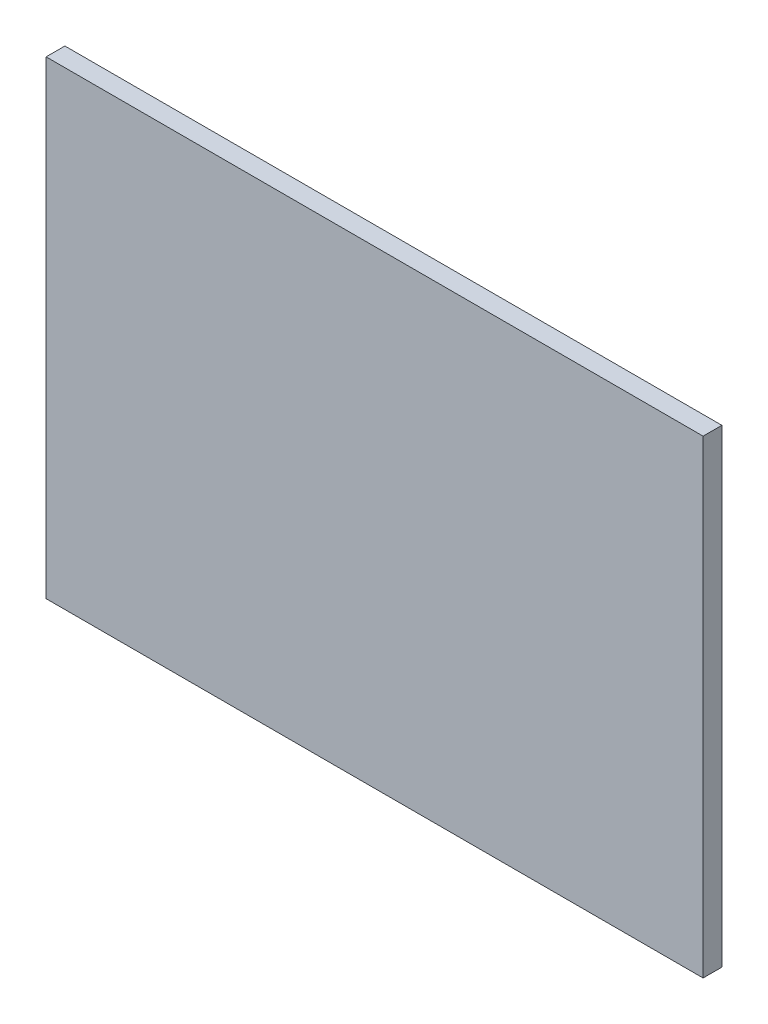
ISO-10303-21;
HEADER;
FILE_DESCRIPTION(('STEP AP214'),'2;1');
FILE_NAME('part.step','',(''),(''),'','','');
FILE_SCHEMA(('AUTOMOTIVE_DESIGN { 1 0 10303 214 1 1 1 1 }'));
ENDSEC;
DATA;
#1=APPLICATION_CONTEXT('core data for automotive mechanical design processes');
#2=APPLICATION_PROTOCOL_DEFINITION('international standard','automotive_design',2000,#1);
#3=PRODUCT_CONTEXT('',#1,'mechanical');
#4=PRODUCT('Part','Part','',(#3));
#5=PRODUCT_RELATED_PRODUCT_CATEGORY('part','',(#4));
#6=PRODUCT_DEFINITION_FORMATION('','',#4);
#7=PRODUCT_DEFINITION_CONTEXT('part definition',#1,'design');
#8=PRODUCT_DEFINITION('design','',#6,#7);
#9=PRODUCT_DEFINITION_SHAPE('','',#8);
#10=(LENGTH_UNIT() NAMED_UNIT(*) SI_UNIT(.MILLI.,.METRE.));
#11=(NAMED_UNIT(*) PLANE_ANGLE_UNIT() SI_UNIT($,.RADIAN.));
#12=(NAMED_UNIT(*) SI_UNIT($,.STERADIAN.) SOLID_ANGLE_UNIT());
#13=UNCERTAINTY_MEASURE_WITH_UNIT(LENGTH_MEASURE(1.E-05),#10,'distance_accuracy_value','');
#14=(GEOMETRIC_REPRESENTATION_CONTEXT(3) GLOBAL_UNCERTAINTY_ASSIGNED_CONTEXT((#13)) GLOBAL_UNIT_ASSIGNED_CONTEXT((#10,
#11,#12)) REPRESENTATION_CONTEXT('',''));
#15=CARTESIAN_POINT('',(0.,0.,0.));
#16=DIRECTION('',(0.,0.,1.));
#17=DIRECTION('',(1.,0.,0.));
#18=AXIS2_PLACEMENT_3D('',#15,#16,#17);
#19=CARTESIAN_POINT('',(0.,0.,2.));
#20=DIRECTION('',(1.,0.,0.));
#21=DIRECTION('',(0.,0.,-1.));
#22=AXIS2_PLACEMENT_3D('',#19,#20,#21);
#23=PLANE('',#22);
#24=DIRECTION('',(0.,-1.,0.));
#25=VECTOR('',#24,1.);
#26=CARTESIAN_POINT('',(0.,0.,0.));
#27=LINE('',#26,#25);
#28=CARTESIAN_POINT('',(0.,50.,0.));
#29=VERTEX_POINT('',#28);
#30=CARTESIAN_POINT('',(0.,0.,0.));
#31=VERTEX_POINT('',#30);
#32=EDGE_CURVE('E98',#29,#31,#27,.T.);
#33=ORIENTED_EDGE('',*,*,#32,.T.);
#34=DIRECTION('',(0.,0.,-1.));
#35=VECTOR('',#34,1.);
#36=CARTESIAN_POINT('',(0.,0.,2.));
#37=LINE('',#36,#35);
#38=CARTESIAN_POINT('',(0.,0.,2.));
#39=VERTEX_POINT('',#38);
#40=EDGE_CURVE('E11',#39,#31,#37,.T.);
#41=ORIENTED_EDGE('',*,*,#40,.F.);
#42=DIRECTION('',(0.,-1.,0.));
#43=VECTOR('',#42,1.);
#44=CARTESIAN_POINT('',(0.,0.,2.));
#45=LINE('',#44,#43);
#46=CARTESIAN_POINT('',(0.,50.,2.));
#47=VERTEX_POINT('',#46);
#48=EDGE_CURVE('E86',#47,#39,#45,.T.);
#49=ORIENTED_EDGE('',*,*,#48,.F.);
#50=DIRECTION('',(0.,0.,-1.));
#51=VECTOR('',#50,1.);
#52=CARTESIAN_POINT('',(0.,50.,2.));
#53=LINE('',#52,#51);
#54=EDGE_CURVE('E94',#47,#29,#53,.T.);
#55=ORIENTED_EDGE('',*,*,#54,.T.);
#56=EDGE_LOOP('',(#33,#41,#49,#55));
#57=FACE_BOUND('',#56,.T.);
#58=ADVANCED_FACE('F35',(#57),#23,.F.);
#59=CARTESIAN_POINT('',(0.,0.,2.));
#60=DIRECTION('',(0.,1.,0.));
#61=DIRECTION('',(0.,0.,1.));
#62=AXIS2_PLACEMENT_3D('',#59,#60,#61);
#63=PLANE('',#62);
#64=DIRECTION('',(1.,0.,0.));
#65=VECTOR('',#64,1.);
#66=CARTESIAN_POINT('',(0.,0.,0.));
#67=LINE('',#66,#65);
#68=CARTESIAN_POINT('',(70.,0.,0.));
#69=VERTEX_POINT('',#68);
#70=EDGE_CURVE('E90',#31,#69,#67,.T.);
#71=ORIENTED_EDGE('',*,*,#70,.T.);
#72=DIRECTION('',(0.,0.,-1.));
#73=VECTOR('',#72,1.);
#74=CARTESIAN_POINT('',(70.,0.,2.));
#75=LINE('',#74,#73);
#76=CARTESIAN_POINT('',(70.,0.,2.));
#77=VERTEX_POINT('',#76);
#78=EDGE_CURVE('E43',#77,#69,#75,.T.);
#79=ORIENTED_EDGE('',*,*,#78,.F.);
#80=DIRECTION('',(1.,0.,0.));
#81=VECTOR('',#80,1.);
#82=CARTESIAN_POINT('',(0.,0.,2.));
#83=LINE('',#82,#81);
#84=EDGE_CURVE('E81',#39,#77,#83,.T.);
#85=ORIENTED_EDGE('',*,*,#84,.F.);
#86=ORIENTED_EDGE('',*,*,#40,.T.);
#87=EDGE_LOOP('',(#71,#79,#85,#86));
#88=FACE_BOUND('',#87,.T.);
#89=ADVANCED_FACE('F89',(#88),#63,.F.);
#90=CARTESIAN_POINT('',(70.,0.,2.));
#91=DIRECTION('',(-1.,0.,0.));
#92=DIRECTION('',(0.,0.,1.));
#93=AXIS2_PLACEMENT_3D('',#90,#91,#92);
#94=PLANE('',#93);
#95=DIRECTION('',(0.,1.,0.));
#96=VECTOR('',#95,1.);
#97=CARTESIAN_POINT('',(70.,0.,0.));
#98=LINE('',#97,#96);
#99=CARTESIAN_POINT('',(70.,50.,0.));
#100=VERTEX_POINT('',#99);
#101=EDGE_CURVE('E68',#69,#100,#98,.T.);
#102=ORIENTED_EDGE('',*,*,#101,.T.);
#103=DIRECTION('',(0.,0.,-1.));
#104=VECTOR('',#103,1.);
#105=CARTESIAN_POINT('',(70.,50.,2.));
#106=LINE('',#105,#104);
#107=CARTESIAN_POINT('',(70.,50.,2.));
#108=VERTEX_POINT('',#107);
#109=EDGE_CURVE('E91',#108,#100,#106,.T.);
#110=ORIENTED_EDGE('',*,*,#109,.F.);
#111=DIRECTION('',(0.,1.,0.));
#112=VECTOR('',#111,1.);
#113=CARTESIAN_POINT('',(70.,0.,2.));
#114=LINE('',#113,#112);
#115=EDGE_CURVE('E84',#77,#108,#114,.T.);
#116=ORIENTED_EDGE('',*,*,#115,.F.);
#117=ORIENTED_EDGE('',*,*,#78,.T.);
#118=EDGE_LOOP('',(#102,#110,#116,#117));
#119=FACE_BOUND('',#118,.T.);
#120=ADVANCED_FACE('F92',(#119),#94,.F.);
#121=CARTESIAN_POINT('',(0.,50.,2.));
#122=DIRECTION('',(0.,-1.,0.));
#123=DIRECTION('',(0.,0.,-1.));
#124=AXIS2_PLACEMENT_3D('',#121,#122,#123);
#125=PLANE('',#124);
#126=DIRECTION('',(-1.,0.,0.));
#127=VECTOR('',#126,1.);
#128=CARTESIAN_POINT('',(0.,50.,0.));
#129=LINE('',#128,#127);
#130=EDGE_CURVE('E74',#100,#29,#129,.T.);
#131=ORIENTED_EDGE('',*,*,#130,.T.);
#132=ORIENTED_EDGE('',*,*,#54,.F.);
#133=DIRECTION('',(-1.,0.,0.));
#134=VECTOR('',#133,1.);
#135=CARTESIAN_POINT('',(0.,50.,2.));
#136=LINE('',#135,#134);
#137=EDGE_CURVE('E51',#108,#47,#136,.T.);
#138=ORIENTED_EDGE('',*,*,#137,.F.);
#139=ORIENTED_EDGE('',*,*,#109,.T.);
#140=EDGE_LOOP('',(#131,#132,#138,#139));
#141=FACE_BOUND('',#140,.T.);
#142=ADVANCED_FACE('F105',(#141),#125,.F.);
#143=CARTESIAN_POINT('',(0.,50.,2.));
#144=DIRECTION('',(0.,0.,-1.));
#145=DIRECTION('',(-1.,0.,0.));
#146=AXIS2_PLACEMENT_3D('',#143,#144,#145);
#147=PLANE('',#146);
#148=ORIENTED_EDGE('',*,*,#48,.T.);
#149=ORIENTED_EDGE('',*,*,#84,.T.);
#150=ORIENTED_EDGE('',*,*,#115,.T.);
#151=ORIENTED_EDGE('',*,*,#137,.T.);
#152=EDGE_LOOP('',(#148,#149,#150,#151));
#153=FACE_BOUND('',#152,.T.);
#154=ADVANCED_FACE('F82',(#153),#147,.F.);
#155=CARTESIAN_POINT('',(0.,50.,0.));
#156=DIRECTION('',(0.,0.,-1.));
#157=DIRECTION('',(-1.,0.,0.));
#158=AXIS2_PLACEMENT_3D('',#155,#156,#157);
#159=PLANE('',#158);
#160=ORIENTED_EDGE('',*,*,#32,.F.);
#161=ORIENTED_EDGE('',*,*,#130,.F.);
#162=ORIENTED_EDGE('',*,*,#101,.F.);
#163=ORIENTED_EDGE('',*,*,#70,.F.);
#164=EDGE_LOOP('',(#160,#161,#162,#163));
#165=FACE_BOUND('',#164,.T.);
#166=ADVANCED_FACE('F108',(#165),#159,.T.);
#167=CLOSED_SHELL('',(#58,#89,#120,#142,#154,#166));
#168=MANIFOLD_SOLID_BREP('B2',#167);
#169=ADVANCED_BREP_SHAPE_REPRESENTATION('',(#18,#168),#14);
#170=SHAPE_DEFINITION_REPRESENTATION(#9,#169);
ENDSEC;
END-ISO-10303-21;
